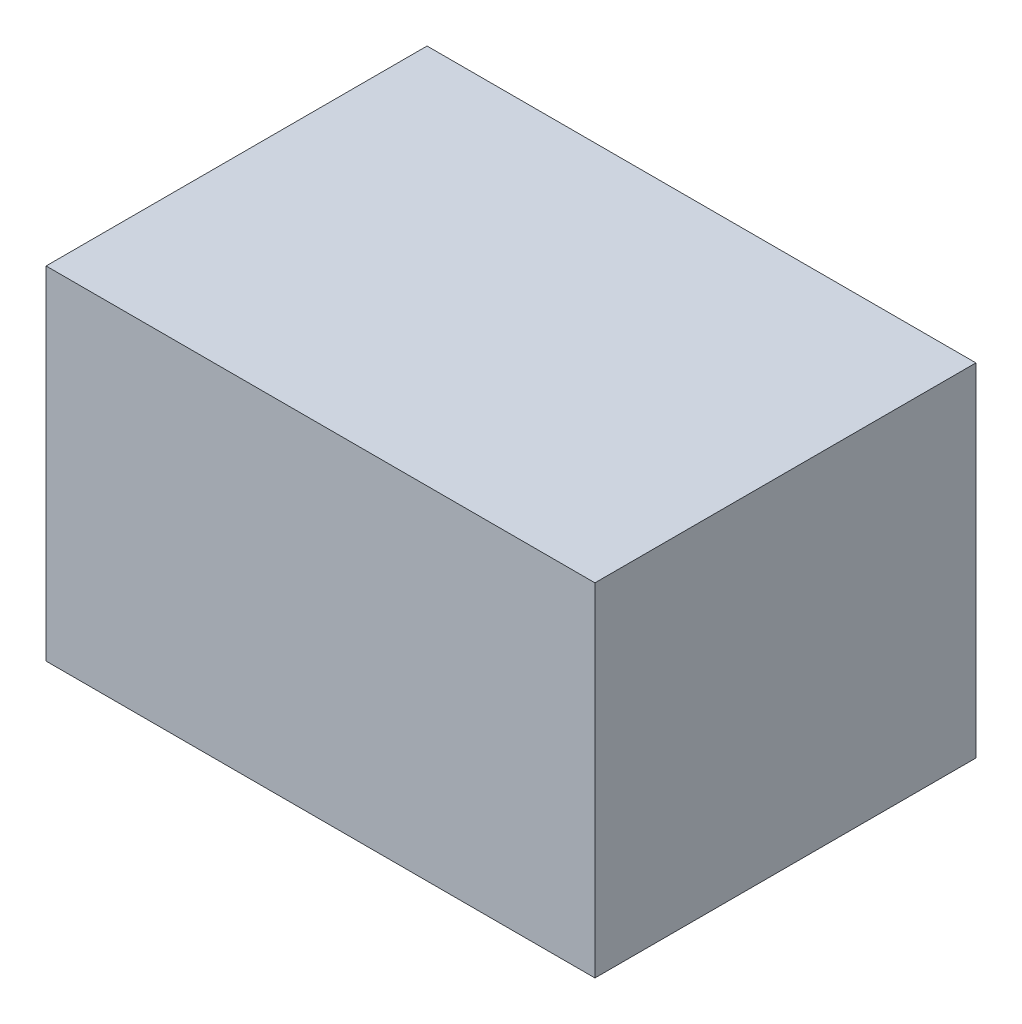
ISO-10303-21;
HEADER;
FILE_DESCRIPTION(('STEP AP214'),'2;1');
FILE_NAME('part.step','',(''),(''),'','','');
FILE_SCHEMA(('AUTOMOTIVE_DESIGN { 1 0 10303 214 1 1 1 1 }'));
ENDSEC;
DATA;
#1=APPLICATION_CONTEXT('core data for automotive mechanical design processes');
#2=APPLICATION_PROTOCOL_DEFINITION('international standard','automotive_design',2000,#1);
#3=PRODUCT_CONTEXT('',#1,'mechanical');
#4=PRODUCT('Part','Part','',(#3));
#5=PRODUCT_RELATED_PRODUCT_CATEGORY('part','',(#4));
#6=PRODUCT_DEFINITION_FORMATION('','',#4);
#7=PRODUCT_DEFINITION_CONTEXT('part definition',#1,'design');
#8=PRODUCT_DEFINITION('design','',#6,#7);
#9=PRODUCT_DEFINITION_SHAPE('','',#8);
#10=(LENGTH_UNIT() NAMED_UNIT(*) SI_UNIT(.MILLI.,.METRE.));
#11=(NAMED_UNIT(*) PLANE_ANGLE_UNIT() SI_UNIT($,.RADIAN.));
#12=(NAMED_UNIT(*) SI_UNIT($,.STERADIAN.) SOLID_ANGLE_UNIT());
#13=UNCERTAINTY_MEASURE_WITH_UNIT(LENGTH_MEASURE(1.E-05),#10,'distance_accuracy_value','');
#14=(GEOMETRIC_REPRESENTATION_CONTEXT(3) GLOBAL_UNCERTAINTY_ASSIGNED_CONTEXT((#13)) GLOBAL_UNIT_ASSIGNED_CONTEXT((#10,
#11,#12)) REPRESENTATION_CONTEXT('',''));
#15=CARTESIAN_POINT('',(0.,0.,0.));
#16=DIRECTION('',(0.,0.,1.));
#17=DIRECTION('',(1.,0.,0.));
#18=AXIS2_PLACEMENT_3D('',#15,#16,#17);
#19=CARTESIAN_POINT('',(2.12499956,1.32500116,0.));
#20=DIRECTION('',(0.,-1.,0.));
#21=DIRECTION('',(0.,0.,-1.));
#22=AXIS2_PLACEMENT_3D('',#19,#20,#21);
#23=PLANE('',#22);
#24=DIRECTION('',(0.,0.,-1.));
#25=VECTOR('',#24,1.);
#26=CARTESIAN_POINT('',(-2.12499956,1.32500116,0.));
#27=LINE('',#26,#25);
#28=CARTESIAN_POINT('',(-2.12499956,1.32500116,0.));
#29=VERTEX_POINT('',#28);
#30=CARTESIAN_POINT('',(-2.12499956,1.32500116,2.94999918));
#31=VERTEX_POINT('',#30);
#32=EDGE_CURVE('E19',#29,#31,#27,.F.);
#33=ORIENTED_EDGE('',*,*,#32,.T.);
#34=DIRECTION('',(-1.,0.,0.));
#35=VECTOR('',#34,1.);
#36=CARTESIAN_POINT('',(-2.12499956,1.32500116,2.94999918));
#37=LINE('',#36,#35);
#38=CARTESIAN_POINT('',(2.12499956,1.32500116,2.94999918));
#39=VERTEX_POINT('',#38);
#40=EDGE_CURVE('E54',#31,#39,#37,.F.);
#41=ORIENTED_EDGE('',*,*,#40,.T.);
#42=DIRECTION('',(0.,0.,1.));
#43=VECTOR('',#42,1.);
#44=CARTESIAN_POINT('',(2.12499956,1.32500116,0.));
#45=LINE('',#44,#43);
#46=CARTESIAN_POINT('',(2.12499956,1.32500116,0.));
#47=VERTEX_POINT('',#46);
#48=EDGE_CURVE('E73',#39,#47,#45,.F.);
#49=ORIENTED_EDGE('',*,*,#48,.T.);
#50=DIRECTION('',(-1.,0.,0.));
#51=VECTOR('',#50,1.);
#52=CARTESIAN_POINT('',(-2.12499956,1.32500116,0.));
#53=LINE('',#52,#51);
#54=EDGE_CURVE('E65',#29,#47,#53,.F.);
#55=ORIENTED_EDGE('',*,*,#54,.F.);
#56=EDGE_LOOP('',(#33,#41,#49,#55));
#57=FACE_BOUND('',#56,.T.);
#58=ADVANCED_FACE('F16',(#57),#23,.F.);
#59=CARTESIAN_POINT('',(-2.12499956,1.32500116,0.));
#60=DIRECTION('',(1.,0.,0.));
#61=DIRECTION('',(0.,0.,-1.));
#62=AXIS2_PLACEMENT_3D('',#59,#60,#61);
#63=PLANE('',#62);
#64=DIRECTION('',(0.,0.,1.));
#65=VECTOR('',#64,1.);
#66=CARTESIAN_POINT('',(-2.12499956,-1.32499862,0.));
#67=LINE('',#66,#65);
#68=CARTESIAN_POINT('',(-2.12499956,-1.324999255,0.));
#69=VERTEX_POINT('',#68);
#70=CARTESIAN_POINT('',(-2.12499956,-1.324999255,2.94999918));
#71=VERTEX_POINT('',#70);
#72=EDGE_CURVE('E71',#69,#71,#67,.T.);
#73=ORIENTED_EDGE('',*,*,#72,.T.);
#74=DIRECTION('',(0.,1.,0.));
#75=VECTOR('',#74,1.);
#76=CARTESIAN_POINT('',(-2.12499956,1.32500116,2.94999918));
#77=LINE('',#76,#75);
#78=EDGE_CURVE('E61',#71,#31,#77,.T.);
#79=ORIENTED_EDGE('',*,*,#78,.T.);
#80=ORIENTED_EDGE('',*,*,#32,.F.);
#81=DIRECTION('',(0.,1.,0.));
#82=VECTOR('',#81,1.);
#83=CARTESIAN_POINT('',(-2.12499956,1.32500116,0.));
#84=LINE('',#83,#82);
#85=EDGE_CURVE('E79',#69,#29,#84,.T.);
#86=ORIENTED_EDGE('',*,*,#85,.F.);
#87=EDGE_LOOP('',(#73,#79,#80,#86));
#88=FACE_BOUND('',#87,.T.);
#89=ADVANCED_FACE('F70',(#88),#63,.F.);
#90=CARTESIAN_POINT('',(-2.12499956,1.32500116,2.94999918));
#91=DIRECTION('',(0.,0.,-1.));
#92=DIRECTION('',(-1.,0.,0.));
#93=AXIS2_PLACEMENT_3D('',#90,#91,#92);
#94=PLANE('',#93);
#95=DIRECTION('',(-0.999999999999821,5.97647181864893E-07,0.));
#96=VECTOR('',#95,1.);
#97=CARTESIAN_POINT('',(-2.12499956,-1.32499862,2.94999918));
#98=LINE('',#97,#96);
#99=CARTESIAN_POINT('',(2.12499956,-1.32500116,2.94999918));
#100=VERTEX_POINT('',#99);
#101=EDGE_CURVE('E82',#71,#100,#98,.F.);
#102=ORIENTED_EDGE('',*,*,#101,.T.);
#103=DIRECTION('',(0.,1.,0.));
#104=VECTOR('',#103,1.);
#105=CARTESIAN_POINT('',(2.12499956,-1.32500116,2.94999918));
#106=LINE('',#105,#104);
#107=EDGE_CURVE('E63',#100,#39,#106,.T.);
#108=ORIENTED_EDGE('',*,*,#107,.T.);
#109=ORIENTED_EDGE('',*,*,#40,.F.);
#110=ORIENTED_EDGE('',*,*,#78,.F.);
#111=EDGE_LOOP('',(#102,#108,#109,#110));
#112=FACE_BOUND('',#111,.T.);
#113=ADVANCED_FACE('F59',(#112),#94,.F.);
#114=CARTESIAN_POINT('',(2.12499956,-1.32500116,0.));
#115=DIRECTION('',(-1.,0.,0.));
#116=DIRECTION('',(0.,0.,1.));
#117=AXIS2_PLACEMENT_3D('',#114,#115,#116);
#118=PLANE('',#117);
#119=ORIENTED_EDGE('',*,*,#48,.F.);
#120=ORIENTED_EDGE('',*,*,#107,.F.);
#121=DIRECTION('',(0.,0.,1.));
#122=VECTOR('',#121,1.);
#123=CARTESIAN_POINT('',(2.12499956,-1.32500116,0.));
#124=LINE('',#123,#122);
#125=CARTESIAN_POINT('',(2.12499956,-1.32500116,0.));
#126=VERTEX_POINT('',#125);
#127=EDGE_CURVE('E25',#100,#126,#124,.F.);
#128=ORIENTED_EDGE('',*,*,#127,.T.);
#129=DIRECTION('',(0.,1.,0.));
#130=VECTOR('',#129,1.);
#131=CARTESIAN_POINT('',(2.12499956,1.32500116,0.));
#132=LINE('',#131,#130);
#133=EDGE_CURVE('E33',#47,#126,#132,.F.);
#134=ORIENTED_EDGE('',*,*,#133,.F.);
#135=EDGE_LOOP('',(#119,#120,#128,#134));
#136=FACE_BOUND('',#135,.T.);
#137=ADVANCED_FACE('F87',(#136),#118,.F.);
#138=CARTESIAN_POINT('',(-2.12499956,1.32500116,0.));
#139=DIRECTION('',(0.,0.,-1.));
#140=DIRECTION('',(-1.,0.,0.));
#141=AXIS2_PLACEMENT_3D('',#138,#139,#140);
#142=PLANE('',#141);
#143=DIRECTION('',(-0.999999999999821,5.97647181864893E-07,0.));
#144=VECTOR('',#143,1.);
#145=CARTESIAN_POINT('',(-2.12499956,-1.32499862,0.));
#146=LINE('',#145,#144);
#147=EDGE_CURVE('E11',#126,#69,#146,.T.);
#148=ORIENTED_EDGE('',*,*,#147,.T.);
#149=ORIENTED_EDGE('',*,*,#85,.T.);
#150=ORIENTED_EDGE('',*,*,#54,.T.);
#151=ORIENTED_EDGE('',*,*,#133,.T.);
#152=EDGE_LOOP('',(#148,#149,#150,#151));
#153=FACE_BOUND('',#152,.T.);
#154=ADVANCED_FACE('F90',(#153),#142,.T.);
#155=CARTESIAN_POINT('',(-2.12499956,-1.32499862,0.));
#156=DIRECTION('',(5.97647181864893E-07,0.999999999999821,0.));
#157=DIRECTION('',(-0.999999999999821,5.97647181864893E-07,0.));
#158=AXIS2_PLACEMENT_3D('',#155,#156,#157);
#159=PLANE('',#158);
#160=ORIENTED_EDGE('',*,*,#127,.F.);
#161=ORIENTED_EDGE('',*,*,#101,.F.);
#162=ORIENTED_EDGE('',*,*,#72,.F.);
#163=ORIENTED_EDGE('',*,*,#147,.F.);
#164=EDGE_LOOP('',(#160,#161,#162,#163));
#165=FACE_BOUND('',#164,.T.);
#166=ADVANCED_FACE('F89',(#165),#159,.F.);
#167=CLOSED_SHELL('',(#58,#89,#113,#137,#154,#166));
#168=MANIFOLD_SOLID_BREP('B1',#167);
#169=ADVANCED_BREP_SHAPE_REPRESENTATION('',(#18,#168),#14);
#170=SHAPE_DEFINITION_REPRESENTATION(#9,#169);
ENDSEC;
END-ISO-10303-21;
